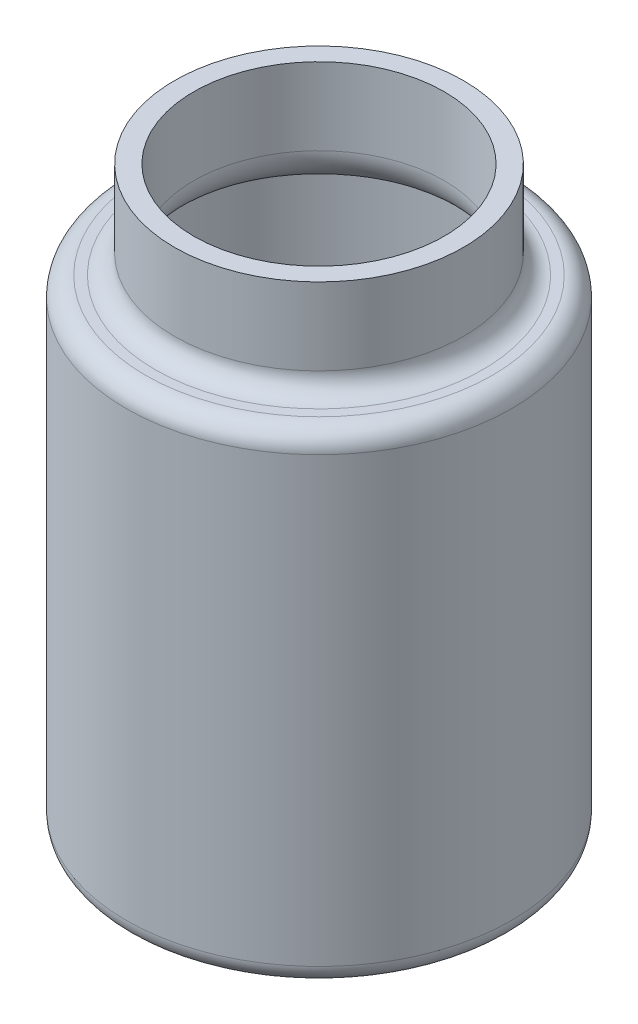
ISO-10303-21;
HEADER;
FILE_DESCRIPTION(('STEP AP214'),'2;1');
FILE_NAME('part.step','',(''),(''),'','','');
FILE_SCHEMA(('AUTOMOTIVE_DESIGN { 1 0 10303 214 1 1 1 1 }'));
ENDSEC;
DATA;
#1=APPLICATION_CONTEXT('core data for automotive mechanical design processes');
#2=APPLICATION_PROTOCOL_DEFINITION('international standard','automotive_design',2000,#1);
#3=PRODUCT_CONTEXT('',#1,'mechanical');
#4=PRODUCT('Part','Part','',(#3));
#5=PRODUCT_RELATED_PRODUCT_CATEGORY('part','',(#4));
#6=PRODUCT_DEFINITION_FORMATION('','',#4);
#7=PRODUCT_DEFINITION_CONTEXT('part definition',#1,'design');
#8=PRODUCT_DEFINITION('design','',#6,#7);
#9=PRODUCT_DEFINITION_SHAPE('','',#8);
#10=(LENGTH_UNIT() NAMED_UNIT(*) SI_UNIT(.MILLI.,.METRE.));
#11=(NAMED_UNIT(*) PLANE_ANGLE_UNIT() SI_UNIT($,.RADIAN.));
#12=(NAMED_UNIT(*) SI_UNIT($,.STERADIAN.) SOLID_ANGLE_UNIT());
#13=UNCERTAINTY_MEASURE_WITH_UNIT(LENGTH_MEASURE(1.E-05),#10,'distance_accuracy_value','');
#14=(GEOMETRIC_REPRESENTATION_CONTEXT(3) GLOBAL_UNCERTAINTY_ASSIGNED_CONTEXT((#13)) GLOBAL_UNIT_ASSIGNED_CONTEXT((#10,
#11,#12)) REPRESENTATION_CONTEXT('',''));
#15=CARTESIAN_POINT('',(0.,0.,0.));
#16=DIRECTION('',(0.,0.,1.));
#17=DIRECTION('',(1.,0.,0.));
#18=AXIS2_PLACEMENT_3D('',#15,#16,#17);
#19=CARTESIAN_POINT('',(0.,63.5,0.));
#20=DIRECTION('',(0.,-1.,0.));
#21=DIRECTION('',(0.,0.,-1.));
#22=AXIS2_PLACEMENT_3D('',#19,#20,#21);
#23=CYLINDRICAL_SURFACE('',#22,25.4);
#24=CARTESIAN_POINT('',(0.,60.96,0.));
#25=DIRECTION('',(0.,1.,0.));
#26=DIRECTION('',(0.,0.,1.));
#27=AXIS2_PLACEMENT_3D('',#24,#25,#26);
#28=CIRCLE('',#27,25.4);
#29=CARTESIAN_POINT('',(0.,60.96,25.4));
#30=VERTEX_POINT('',#29);
#31=EDGE_CURVE('E49',#30,#30,#28,.F.);
#32=ORIENTED_EDGE('',*,*,#31,.T.);
#33=EDGE_LOOP('',(#32));
#34=FACE_BOUND('',#33,.T.);
#35=CARTESIAN_POINT('',(0.,2.54,0.));
#36=DIRECTION('',(0.,1.,0.));
#37=DIRECTION('',(0.,0.,1.));
#38=AXIS2_PLACEMENT_3D('',#35,#36,#37);
#39=CIRCLE('',#38,25.4);
#40=CARTESIAN_POINT('',(0.,2.54,25.4));
#41=VERTEX_POINT('',#40);
#42=EDGE_CURVE('E54',#41,#41,#39,.T.);
#43=ORIENTED_EDGE('',*,*,#42,.T.);
#44=EDGE_LOOP('',(#43));
#45=FACE_BOUND('',#44,.T.);
#46=ADVANCED_FACE('F41',(#34,#45),#23,.T.);
#47=CARTESIAN_POINT('',(0.,63.5,0.));
#48=DIRECTION('',(0.,1.,0.));
#49=DIRECTION('',(0.,0.,1.));
#50=AXIS2_PLACEMENT_3D('',#47,#48,#49);
#51=PLANE('',#50);
#52=CARTESIAN_POINT('',(0.,63.5,0.));
#53=DIRECTION('',(0.,1.,0.));
#54=DIRECTION('',(0.,0.,1.));
#55=AXIS2_PLACEMENT_3D('',#52,#53,#54);
#56=CIRCLE('',#55,21.59);
#57=CARTESIAN_POINT('',(0.,63.5,21.59));
#58=VERTEX_POINT('',#57);
#59=EDGE_CURVE('E65',#58,#58,#56,.F.);
#60=ORIENTED_EDGE('',*,*,#59,.T.);
#61=EDGE_LOOP('',(#60));
#62=FACE_BOUND('',#61,.T.);
#63=CARTESIAN_POINT('',(0.,63.5,0.));
#64=DIRECTION('',(0.,1.,0.));
#65=DIRECTION('',(0.,0.,1.));
#66=AXIS2_PLACEMENT_3D('',#63,#64,#65);
#67=CIRCLE('',#66,22.86);
#68=CARTESIAN_POINT('',(0.,63.5,22.86));
#69=VERTEX_POINT('',#68);
#70=EDGE_CURVE('E69',#69,#69,#67,.T.);
#71=ORIENTED_EDGE('',*,*,#70,.T.);
#72=EDGE_LOOP('',(#71));
#73=FACE_BOUND('',#72,.T.);
#74=ADVANCED_FACE('F116',(#62,#73),#51,.T.);
#75=CARTESIAN_POINT('',(0.,0.,0.));
#76=DIRECTION('',(0.,1.,0.));
#77=DIRECTION('',(0.,0.,1.));
#78=AXIS2_PLACEMENT_3D('',#75,#76,#77);
#79=PLANE('',#78);
#80=CARTESIAN_POINT('',(0.,0.,0.));
#81=DIRECTION('',(0.,1.,0.));
#82=DIRECTION('',(0.,0.,1.));
#83=AXIS2_PLACEMENT_3D('',#80,#81,#82);
#84=CIRCLE('',#83,22.86);
#85=CARTESIAN_POINT('',(0.,0.,22.86));
#86=VERTEX_POINT('',#85);
#87=EDGE_CURVE('E10',#86,#86,#84,.F.);
#88=ORIENTED_EDGE('',*,*,#87,.T.);
#89=EDGE_LOOP('',(#88));
#90=FACE_BOUND('',#89,.T.);
#91=ADVANCED_FACE('F121',(#90),#79,.F.);
#92=CARTESIAN_POINT('',(0.,76.2,0.));
#93=DIRECTION('',(0.,-1.,0.));
#94=DIRECTION('',(0.,0.,-1.));
#95=AXIS2_PLACEMENT_3D('',#92,#93,#94);
#96=CYLINDRICAL_SURFACE('',#95,19.05);
#97=CARTESIAN_POINT('',(0.,66.04,0.));
#98=DIRECTION('',(0.,1.,0.));
#99=DIRECTION('',(0.,0.,1.));
#100=AXIS2_PLACEMENT_3D('',#97,#98,#99);
#101=CIRCLE('',#100,19.05);
#102=CARTESIAN_POINT('',(0.,66.04,-19.05));
#103=VERTEX_POINT('',#102);
#104=EDGE_CURVE('E59',#103,#103,#101,.T.);
#105=CARTESIAN_POINT('',(0.,76.2,0.));
#106=DIRECTION('',(0.,1.,0.));
#107=DIRECTION('',(0.,0.,1.));
#108=AXIS2_PLACEMENT_3D('',#105,#106,#107);
#109=CIRCLE('',#108,19.05);
#110=CARTESIAN_POINT('',(0.,76.2,-19.05));
#111=VERTEX_POINT('',#110);
#112=EDGE_CURVE('E73',#111,#111,#109,.T.);
#113=CARTESIAN_POINT('',(0.,66.04,-19.05));
#114=CARTESIAN_POINT('',(0.,66.1458333333333,-19.05));
#115=CARTESIAN_POINT('',(0.,66.2516666666667,-19.05));
#116=CARTESIAN_POINT('',(0.,66.4633333333333,-19.05));
#117=CARTESIAN_POINT('',(0.,66.5691666666667,-19.05));
#118=CARTESIAN_POINT('',(0.,66.7808333333333,-19.05));
#119=CARTESIAN_POINT('',(0.,66.8866666666667,-19.05));
#120=CARTESIAN_POINT('',(0.,67.0983333333333,-19.05));
#121=CARTESIAN_POINT('',(0.,67.2041666666667,-19.05));
#122=CARTESIAN_POINT('',(0.,67.4158333333333,-19.05));
#123=CARTESIAN_POINT('',(0.,67.5216666666667,-19.05));
#124=CARTESIAN_POINT('',(0.,67.7333333333333,-19.05));
#125=CARTESIAN_POINT('',(0.,67.8391666666667,-19.05));
#126=CARTESIAN_POINT('',(0.,68.0508333333333,-19.05));
#127=CARTESIAN_POINT('',(0.,68.1566666666667,-19.05));
#128=CARTESIAN_POINT('',(0.,68.3683333333333,-19.05));
#129=CARTESIAN_POINT('',(0.,68.4741666666667,-19.05));
#130=CARTESIAN_POINT('',(0.,68.6858333333333,-19.05));
#131=CARTESIAN_POINT('',(0.,68.7916666666667,-19.05));
#132=CARTESIAN_POINT('',(0.,69.0033333333333,-19.05));
#133=CARTESIAN_POINT('',(0.,69.1091666666667,-19.05));
#134=CARTESIAN_POINT('',(0.,69.3208333333333,-19.05));
#135=CARTESIAN_POINT('',(0.,69.4266666666667,-19.05));
#136=CARTESIAN_POINT('',(0.,69.6383333333333,-19.05));
#137=CARTESIAN_POINT('',(0.,69.7441666666667,-19.05));
#138=CARTESIAN_POINT('',(0.,69.9558333333333,-19.05));
#139=CARTESIAN_POINT('',(0.,70.0616666666667,-19.05));
#140=CARTESIAN_POINT('',(0.,70.2733333333333,-19.05));
#141=CARTESIAN_POINT('',(0.,70.3791666666667,-19.05));
#142=CARTESIAN_POINT('',(0.,70.5908333333333,-19.05));
#143=CARTESIAN_POINT('',(0.,70.6966666666667,-19.05));
#144=CARTESIAN_POINT('',(0.,70.9083333333333,-19.05));
#145=CARTESIAN_POINT('',(0.,71.0141666666667,-19.05));
#146=CARTESIAN_POINT('',(0.,71.2258333333333,-19.05));
#147=CARTESIAN_POINT('',(0.,71.3316666666667,-19.05));
#148=CARTESIAN_POINT('',(0.,71.5433333333333,-19.05));
#149=CARTESIAN_POINT('',(0.,71.6491666666667,-19.05));
#150=CARTESIAN_POINT('',(0.,71.8608333333333,-19.05));
#151=CARTESIAN_POINT('',(0.,71.9666666666667,-19.05));
#152=CARTESIAN_POINT('',(0.,72.1783333333333,-19.05));
#153=CARTESIAN_POINT('',(0.,72.2841666666667,-19.05));
#154=CARTESIAN_POINT('',(0.,72.4958333333333,-19.05));
#155=CARTESIAN_POINT('',(0.,72.6016666666667,-19.05));
#156=CARTESIAN_POINT('',(0.,72.8133333333333,-19.05));
#157=CARTESIAN_POINT('',(0.,72.9191666666667,-19.05));
#158=CARTESIAN_POINT('',(0.,73.1308333333333,-19.05));
#159=CARTESIAN_POINT('',(0.,73.2366666666667,-19.05));
#160=CARTESIAN_POINT('',(0.,73.4483333333333,-19.05));
#161=CARTESIAN_POINT('',(0.,73.5541666666667,-19.05));
#162=CARTESIAN_POINT('',(0.,73.7658333333333,-19.05));
#163=CARTESIAN_POINT('',(0.,73.8716666666667,-19.05));
#164=CARTESIAN_POINT('',(0.,74.0833333333333,-19.05));
#165=CARTESIAN_POINT('',(0.,74.1891666666667,-19.05));
#166=CARTESIAN_POINT('',(0.,74.4008333333333,-19.05));
#167=CARTESIAN_POINT('',(0.,74.5066666666667,-19.05));
#168=CARTESIAN_POINT('',(0.,74.7183333333333,-19.05));
#169=CARTESIAN_POINT('',(0.,74.8241666666667,-19.05));
#170=CARTESIAN_POINT('',(0.,75.0358333333333,-19.05));
#171=CARTESIAN_POINT('',(0.,75.1416666666667,-19.05));
#172=CARTESIAN_POINT('',(0.,75.3533333333333,-19.05));
#173=CARTESIAN_POINT('',(0.,75.4591666666667,-19.05));
#174=CARTESIAN_POINT('',(0.,75.6708333333333,-19.05));
#175=CARTESIAN_POINT('',(0.,75.7766666666667,-19.05));
#176=CARTESIAN_POINT('',(0.,75.9883333333333,-19.05));
#177=CARTESIAN_POINT('',(0.,76.0941666666667,-19.05));
#178=CARTESIAN_POINT('',(0.,76.2,-19.05));
#179=B_SPLINE_CURVE_WITH_KNOTS('',3,(#113,#114,#115,#116,#117,#118,#119,#120,#121,#122,#123,
#124,#125,#126,#127,#128,#129,#130,#131,#132,#133,#134,#135,#136,#137,#138,#139,#140,#141,#142,
#143,#144,#145,#146,#147,#148,#149,#150,#151,#152,#153,#154,#155,#156,#157,#158,#159,#160,#161,
#162,#163,#164,#165,#166,#167,#168,#169,#170,#171,#172,#173,#174,#175,#176,#177,#178),
.UNSPECIFIED.,.F.,.F.,(4,2,2,2,2,2,2,2,2,2,2,2,2,2,2,2,2,2,2,2,2,2,2,2,2,2,2,2,2,2,2,2,4),(0.,
0.317499999999998,0.634999999999997,0.952499999999995,1.26999999999999,1.58749999999999,
1.90499999999999,2.2225,2.54,2.8575,3.175,3.4925,3.80999999999999,4.12749999999999,
4.44499999999999,4.76249999999999,5.08,5.3975,5.715,6.0325,6.34999999999999,6.66749999999999,
6.98499999999999,7.30249999999999,7.62,7.9375,8.255,8.5725,8.89,9.20749999999999,
9.52499999999999,9.84249999999999,10.16),.UNSPECIFIED.);
#180=EDGE_CURVE('BSEAM214',#103,#111,#179,.T.);
#181=ORIENTED_EDGE('',*,*,#104,.T.);
#182=ORIENTED_EDGE('',*,*,#112,.F.);
#183=ORIENTED_EDGE('',*,*,#180,.T.);
#184=ORIENTED_EDGE('',*,*,#180,.F.);
#185=EDGE_LOOP('',(#181,#183,#182,#184));
#186=FACE_BOUND('',#185,.T.);
#187=ADVANCED_FACE('F214',(#186),#96,.T.);
#188=CARTESIAN_POINT('',(0.,76.2,0.));
#189=DIRECTION('',(0.,1.,0.));
#190=DIRECTION('',(0.,0.,1.));
#191=AXIS2_PLACEMENT_3D('',#188,#189,#190);
#192=PLANE('',#191);
#193=CARTESIAN_POINT('',(0.,76.2,0.));
#194=DIRECTION('',(0.,1.,0.));
#195=DIRECTION('',(0.,0.,1.));
#196=AXIS2_PLACEMENT_3D('',#193,#194,#195);
#197=CIRCLE('',#196,16.51);
#198=CARTESIAN_POINT('',(0.,76.2,-16.51));
#199=VERTEX_POINT('',#198);
#200=EDGE_CURVE('E78',#199,#199,#197,.T.);
#201=ORIENTED_EDGE('',*,*,#200,.F.);
#202=EDGE_LOOP('',(#201));
#203=FACE_BOUND('',#202,.T.);
#204=ORIENTED_EDGE('',*,*,#112,.T.);
#205=EDGE_LOOP('',(#204));
#206=FACE_BOUND('',#205,.T.);
#207=ADVANCED_FACE('F130',(#203,#206),#192,.T.);
#208=CARTESIAN_POINT('',(0.,66.04,0.));
#209=DIRECTION('',(0.,1.,0.));
#210=DIRECTION('',(0.,0.,1.));
#211=AXIS2_PLACEMENT_3D('',#208,#209,#210);
#212=TOROIDAL_SURFACE('',#211,21.59,2.54);
#213=ORIENTED_EDGE('',*,*,#104,.F.);
#214=EDGE_LOOP('',(#213));
#215=FACE_BOUND('',#214,.T.);
#216=ORIENTED_EDGE('',*,*,#59,.F.);
#217=EDGE_LOOP('',(#216));
#218=FACE_BOUND('',#217,.T.);
#219=ADVANCED_FACE('F127',(#215,#218),#212,.F.);
#220=CARTESIAN_POINT('',(0.,60.96,0.));
#221=DIRECTION('',(0.,1.,0.));
#222=DIRECTION('',(0.,0.,1.));
#223=AXIS2_PLACEMENT_3D('',#220,#221,#222);
#224=TOROIDAL_SURFACE('',#223,22.86,2.54);
#225=ORIENTED_EDGE('',*,*,#31,.F.);
#226=EDGE_LOOP('',(#225));
#227=FACE_BOUND('',#226,.T.);
#228=ORIENTED_EDGE('',*,*,#70,.F.);
#229=EDGE_LOOP('',(#228));
#230=FACE_BOUND('',#229,.T.);
#231=ADVANCED_FACE('F129',(#227,#230),#224,.T.);
#232=CARTESIAN_POINT('',(0.,2.54,0.));
#233=DIRECTION('',(0.,1.,0.));
#234=DIRECTION('',(0.,0.,1.));
#235=AXIS2_PLACEMENT_3D('',#232,#233,#234);
#236=TOROIDAL_SURFACE('',#235,22.86,2.54);
#237=ORIENTED_EDGE('',*,*,#87,.F.);
#238=EDGE_LOOP('',(#237));
#239=FACE_BOUND('',#238,.T.);
#240=ORIENTED_EDGE('',*,*,#42,.F.);
#241=EDGE_LOOP('',(#240));
#242=FACE_BOUND('',#241,.T.);
#243=ADVANCED_FACE('F43',(#239,#242),#236,.T.);
#244=CARTESIAN_POINT('',(0.,63.5,0.));
#245=DIRECTION('',(0.,-1.,0.));
#246=DIRECTION('',(0.,0.,-1.));
#247=AXIS2_PLACEMENT_3D('',#244,#245,#246);
#248=CYLINDRICAL_SURFACE('',#247,22.86);
#249=CARTESIAN_POINT('',(0.,60.96,0.));
#250=DIRECTION('',(0.,1.,0.));
#251=DIRECTION('',(0.,0.,1.));
#252=AXIS2_PLACEMENT_3D('',#249,#250,#251);
#253=CIRCLE('',#252,22.86);
#254=CARTESIAN_POINT('',(0.,60.96,22.86));
#255=VERTEX_POINT('',#254);
#256=EDGE_CURVE('E82',#255,#255,#253,.T.);
#257=ORIENTED_EDGE('',*,*,#256,.T.);
#258=EDGE_LOOP('',(#257));
#259=FACE_BOUND('',#258,.T.);
#260=CARTESIAN_POINT('',(0.,2.54,0.));
#261=DIRECTION('',(0.,1.,0.));
#262=DIRECTION('',(0.,0.,1.));
#263=AXIS2_PLACEMENT_3D('',#260,#261,#262);
#264=CIRCLE('',#263,22.86);
#265=CARTESIAN_POINT('',(0.,2.54,22.86));
#266=VERTEX_POINT('',#265);
#267=EDGE_CURVE('E77',#266,#266,#264,.T.);
#268=ORIENTED_EDGE('',*,*,#267,.F.);
#269=EDGE_LOOP('',(#268));
#270=FACE_BOUND('',#269,.T.);
#271=ADVANCED_FACE('F98',(#259,#270),#248,.F.);
#272=CARTESIAN_POINT('',(0.,60.96,0.));
#273=DIRECTION('',(0.,1.,0.));
#274=DIRECTION('',(0.,0.,1.));
#275=AXIS2_PLACEMENT_3D('',#272,#273,#274);
#276=PLANE('',#275);
#277=CARTESIAN_POINT('',(0.,60.96,0.));
#278=DIRECTION('',(0.,1.,0.));
#279=DIRECTION('',(0.,0.,1.));
#280=AXIS2_PLACEMENT_3D('',#277,#278,#279);
#281=CIRCLE('',#280,21.59);
#282=CARTESIAN_POINT('',(0.,60.96,21.59));
#283=VERTEX_POINT('',#282);
#284=EDGE_CURVE('E87',#283,#283,#281,.F.);
#285=ORIENTED_EDGE('',*,*,#284,.F.);
#286=EDGE_LOOP('',(#285));
#287=FACE_BOUND('',#286,.T.);
#288=ORIENTED_EDGE('',*,*,#256,.F.);
#289=EDGE_LOOP('',(#288));
#290=FACE_BOUND('',#289,.T.);
#291=ADVANCED_FACE('F101',(#287,#290),#276,.F.);
#292=CARTESIAN_POINT('',(0.,2.54,0.));
#293=DIRECTION('',(0.,1.,0.));
#294=DIRECTION('',(0.,0.,1.));
#295=AXIS2_PLACEMENT_3D('',#292,#293,#294);
#296=PLANE('',#295);
#297=ORIENTED_EDGE('',*,*,#267,.T.);
#298=EDGE_LOOP('',(#297));
#299=FACE_BOUND('',#298,.T.);
#300=ADVANCED_FACE('F103',(#299),#296,.T.);
#301=CARTESIAN_POINT('',(0.,76.2,0.));
#302=DIRECTION('',(0.,-1.,0.));
#303=DIRECTION('',(0.,0.,-1.));
#304=AXIS2_PLACEMENT_3D('',#301,#302,#303);
#305=CYLINDRICAL_SURFACE('',#304,16.51);
#306=CARTESIAN_POINT('',(0.,66.04,0.));
#307=DIRECTION('',(0.,-1.,0.));
#308=DIRECTION('',(0.,0.,-1.));
#309=AXIS2_PLACEMENT_3D('',#306,#307,#308);
#310=CIRCLE('',#309,16.51);
#311=CARTESIAN_POINT('',(0.,66.04,-16.51));
#312=VERTEX_POINT('',#311);
#313=EDGE_CURVE('E83',#312,#312,#310,.F.);
#314=CARTESIAN_POINT('',(0.,66.04,-16.51));
#315=CARTESIAN_POINT('',(0.,66.1458333333333,-16.51));
#316=CARTESIAN_POINT('',(0.,66.2516666666667,-16.51));
#317=CARTESIAN_POINT('',(0.,66.4633333333334,-16.51));
#318=CARTESIAN_POINT('',(0.,66.5691666666667,-16.51));
#319=CARTESIAN_POINT('',(0.,66.7808333333333,-16.51));
#320=CARTESIAN_POINT('',(0.,66.8866666666667,-16.51));
#321=CARTESIAN_POINT('',(0.,67.0983333333333,-16.51));
#322=CARTESIAN_POINT('',(0.,67.2041666666667,-16.51));
#323=CARTESIAN_POINT('',(0.,67.4158333333333,-16.51));
#324=CARTESIAN_POINT('',(0.,67.5216666666667,-16.51));
#325=CARTESIAN_POINT('',(0.,67.7333333333333,-16.51));
#326=CARTESIAN_POINT('',(0.,67.8391666666667,-16.51));
#327=CARTESIAN_POINT('',(0.,68.0508333333333,-16.51));
#328=CARTESIAN_POINT('',(0.,68.1566666666667,-16.51));
#329=CARTESIAN_POINT('',(0.,68.3683333333333,-16.51));
#330=CARTESIAN_POINT('',(0.,68.4741666666667,-16.51));
#331=CARTESIAN_POINT('',(0.,68.6858333333333,-16.51));
#332=CARTESIAN_POINT('',(0.,68.7916666666667,-16.51));
#333=CARTESIAN_POINT('',(0.,69.0033333333333,-16.51));
#334=CARTESIAN_POINT('',(0.,69.1091666666667,-16.51));
#335=CARTESIAN_POINT('',(0.,69.3208333333333,-16.51));
#336=CARTESIAN_POINT('',(0.,69.4266666666667,-16.51));
#337=CARTESIAN_POINT('',(0.,69.6383333333333,-16.51));
#338=CARTESIAN_POINT('',(0.,69.7441666666667,-16.51));
#339=CARTESIAN_POINT('',(0.,69.9558333333333,-16.51));
#340=CARTESIAN_POINT('',(0.,70.0616666666667,-16.51));
#341=CARTESIAN_POINT('',(0.,70.2733333333333,-16.51));
#342=CARTESIAN_POINT('',(0.,70.3791666666667,-16.51));
#343=CARTESIAN_POINT('',(0.,70.5908333333333,-16.51));
#344=CARTESIAN_POINT('',(0.,70.6966666666667,-16.51));
#345=CARTESIAN_POINT('',(0.,70.9083333333333,-16.51));
#346=CARTESIAN_POINT('',(0.,71.0141666666667,-16.51));
#347=CARTESIAN_POINT('',(0.,71.2258333333333,-16.51));
#348=CARTESIAN_POINT('',(0.,71.3316666666667,-16.51));
#349=CARTESIAN_POINT('',(0.,71.5433333333333,-16.51));
#350=CARTESIAN_POINT('',(0.,71.6491666666667,-16.51));
#351=CARTESIAN_POINT('',(0.,71.8608333333333,-16.51));
#352=CARTESIAN_POINT('',(0.,71.9666666666667,-16.51));
#353=CARTESIAN_POINT('',(0.,72.1783333333333,-16.51));
#354=CARTESIAN_POINT('',(0.,72.2841666666667,-16.51));
#355=CARTESIAN_POINT('',(0.,72.4958333333333,-16.51));
#356=CARTESIAN_POINT('',(0.,72.6016666666667,-16.51));
#357=CARTESIAN_POINT('',(0.,72.8133333333333,-16.51));
#358=CARTESIAN_POINT('',(0.,72.9191666666667,-16.51));
#359=CARTESIAN_POINT('',(0.,73.1308333333333,-16.51));
#360=CARTESIAN_POINT('',(0.,73.2366666666667,-16.51));
#361=CARTESIAN_POINT('',(0.,73.4483333333333,-16.51));
#362=CARTESIAN_POINT('',(0.,73.5541666666667,-16.51));
#363=CARTESIAN_POINT('',(0.,73.7658333333333,-16.51));
#364=CARTESIAN_POINT('',(0.,73.8716666666667,-16.51));
#365=CARTESIAN_POINT('',(0.,74.0833333333333,-16.51));
#366=CARTESIAN_POINT('',(0.,74.1891666666667,-16.51));
#367=CARTESIAN_POINT('',(0.,74.4008333333333,-16.51));
#368=CARTESIAN_POINT('',(0.,74.5066666666667,-16.51));
#369=CARTESIAN_POINT('',(0.,74.7183333333333,-16.51));
#370=CARTESIAN_POINT('',(0.,74.8241666666667,-16.51));
#371=CARTESIAN_POINT('',(0.,75.0358333333333,-16.51));
#372=CARTESIAN_POINT('',(0.,75.1416666666667,-16.51));
#373=CARTESIAN_POINT('',(0.,75.3533333333333,-16.51));
#374=CARTESIAN_POINT('',(0.,75.4591666666667,-16.51));
#375=CARTESIAN_POINT('',(0.,75.6708333333333,-16.51));
#376=CARTESIAN_POINT('',(0.,75.7766666666667,-16.51));
#377=CARTESIAN_POINT('',(0.,75.9883333333333,-16.51));
#378=CARTESIAN_POINT('',(0.,76.0941666666667,-16.51));
#379=CARTESIAN_POINT('',(0.,76.2,-16.51));
#380=B_SPLINE_CURVE_WITH_KNOTS('',3,(#314,#315,#316,#317,#318,#319,#320,#321,#322,#323,#324,
#325,#326,#327,#328,#329,#330,#331,#332,#333,#334,#335,#336,#337,#338,#339,#340,#341,#342,#343,
#344,#345,#346,#347,#348,#349,#350,#351,#352,#353,#354,#355,#356,#357,#358,#359,#360,#361,#362,
#363,#364,#365,#366,#367,#368,#369,#370,#371,#372,#373,#374,#375,#376,#377,#378,#379),
.UNSPECIFIED.,.F.,.F.,(4,2,2,2,2,2,2,2,2,2,2,2,2,2,2,2,2,2,2,2,2,2,2,2,2,2,2,2,2,2,2,2,4),(0.,
0.317500000000012,0.635000000000011,0.952500000000009,1.27000000000001,1.58750000000001,1.905,
2.2225,2.54,2.8575,3.175,3.4925,3.81000000000001,4.12750000000001,4.445,4.7625,5.08,5.3975,
5.715,6.0325,6.34999999999999,6.66749999999999,6.985,7.3025,7.62,7.9375,8.255,8.5725,8.89,
9.20749999999999,9.52499999999999,9.84249999999999,10.16),.UNSPECIFIED.);
#381=EDGE_CURVE('BSEAM110',#312,#199,#380,.T.);
#382=ORIENTED_EDGE('',*,*,#313,.F.);
#383=ORIENTED_EDGE('',*,*,#200,.T.);
#384=ORIENTED_EDGE('',*,*,#381,.T.);
#385=ORIENTED_EDGE('',*,*,#381,.F.);
#386=EDGE_LOOP('',(#382,#384,#383,#385));
#387=FACE_BOUND('',#386,.T.);
#388=ADVANCED_FACE('F110',(#387),#305,.F.);
#389=CARTESIAN_POINT('',(0.,66.04,0.));
#390=DIRECTION('',(0.,1.,0.));
#391=DIRECTION('',(0.,0.,1.));
#392=AXIS2_PLACEMENT_3D('',#389,#390,#391);
#393=TOROIDAL_SURFACE('',#392,21.59,5.08);
#394=ORIENTED_EDGE('',*,*,#313,.T.);
#395=EDGE_LOOP('',(#394));
#396=FACE_BOUND('',#395,.T.);
#397=ORIENTED_EDGE('',*,*,#284,.T.);
#398=EDGE_LOOP('',(#397));
#399=FACE_BOUND('',#398,.T.);
#400=ADVANCED_FACE('F175',(#396,#399),#393,.T.);
#401=CLOSED_SHELL('',(#46,#74,#91,#187,#207,#219,#231,#243,#271,#291,#300,#388,#400));
#402=MANIFOLD_SOLID_BREP('B2',#401);
#403=ADVANCED_BREP_SHAPE_REPRESENTATION('',(#18,#402),#14);
#404=SHAPE_DEFINITION_REPRESENTATION(#9,#403);
ENDSEC;
END-ISO-10303-21;
